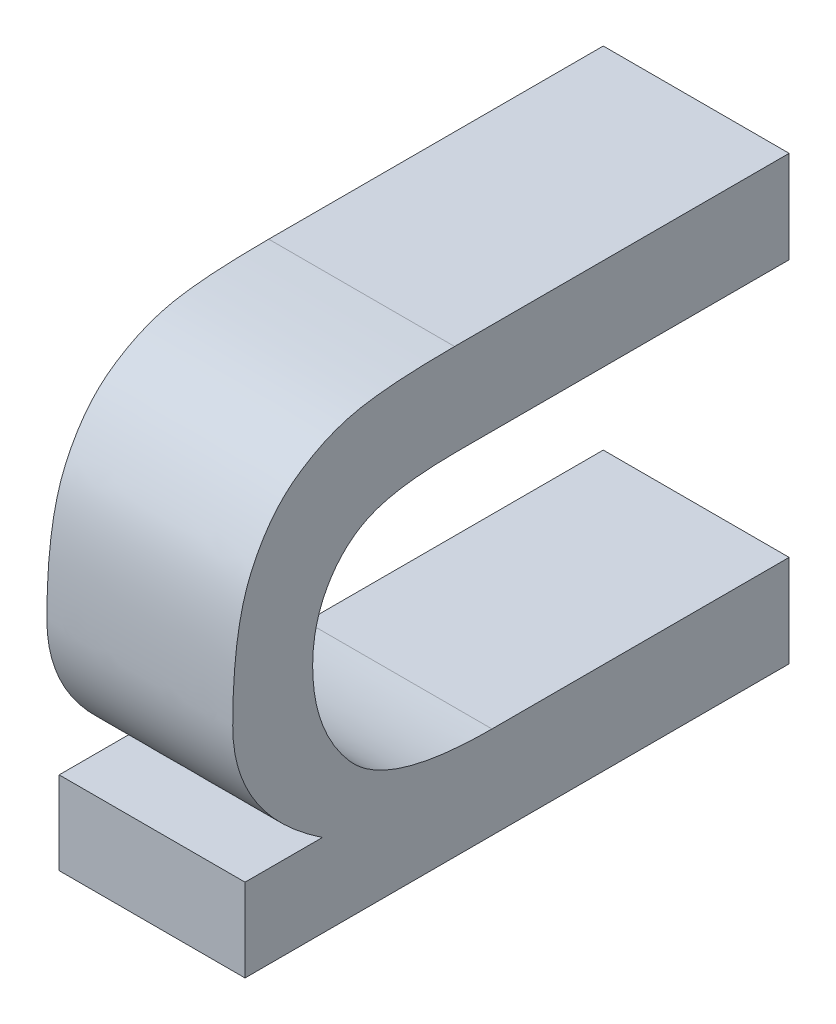
ISO-10303-21;
HEADER;
FILE_DESCRIPTION(('STEP AP214'),'2;1');
FILE_NAME('part.step','',(''),(''),'','','');
FILE_SCHEMA(('AUTOMOTIVE_DESIGN { 1 0 10303 214 1 1 1 1 }'));
ENDSEC;
DATA;
#1=APPLICATION_CONTEXT('core data for automotive mechanical design processes');
#2=APPLICATION_PROTOCOL_DEFINITION('international standard','automotive_design',2000,#1);
#3=PRODUCT_CONTEXT('',#1,'mechanical');
#4=PRODUCT('Part','Part','',(#3));
#5=PRODUCT_RELATED_PRODUCT_CATEGORY('part','',(#4));
#6=PRODUCT_DEFINITION_FORMATION('','',#4);
#7=PRODUCT_DEFINITION_CONTEXT('part definition',#1,'design');
#8=PRODUCT_DEFINITION('design','',#6,#7);
#9=PRODUCT_DEFINITION_SHAPE('','',#8);
#10=(LENGTH_UNIT() NAMED_UNIT(*) SI_UNIT(.MILLI.,.METRE.));
#11=(NAMED_UNIT(*) PLANE_ANGLE_UNIT() SI_UNIT($,.RADIAN.));
#12=(NAMED_UNIT(*) SI_UNIT($,.STERADIAN.) SOLID_ANGLE_UNIT());
#13=UNCERTAINTY_MEASURE_WITH_UNIT(LENGTH_MEASURE(1.E-05),#10,'distance_accuracy_value','');
#14=(GEOMETRIC_REPRESENTATION_CONTEXT(3) GLOBAL_UNCERTAINTY_ASSIGNED_CONTEXT((#13)) GLOBAL_UNIT_ASSIGNED_CONTEXT((#10,
#11,#12)) REPRESENTATION_CONTEXT('',''));
#15=CARTESIAN_POINT('',(0.,0.,0.));
#16=DIRECTION('',(0.,0.,1.));
#17=DIRECTION('',(1.,0.,0.));
#18=AXIS2_PLACEMENT_3D('',#15,#16,#17);
#19=CARTESIAN_POINT('',(4.55229940712896,-38.1413479114735,-8.87538537038162));
#20=DIRECTION('',(-1.,0.,0.));
#21=DIRECTION('',(0.,0.,1.));
#22=AXIS2_PLACEMENT_3D('',#19,#20,#21);
#23=PLANE('',#22);
#24=CARTESIAN_POINT('',(4.55229940712895,-38.0669559077334,-8.96104471327083));
#25=CARTESIAN_POINT('',(4.55229940712895,-38.034704441545,-8.91280534076686));
#26=CARTESIAN_POINT('',(4.55229940712893,-37.9473222639236,-8.91280534076686));
#27=CARTESIAN_POINT('',(4.55229940712893,-37.9029420412199,-8.93182543621128));
#28=CARTESIAN_POINT('',(4.55229940712892,-37.8808897566466,-8.96269863461382));
#29=CARTESIAN_POINT('',(4.55229940712892,-37.8737227641603,-8.99770663637385));
#30=CARTESIAN_POINT('',(4.55229940712892,-37.8737227641603,-9.03216333101954));
#31=(BOUNDED_CURVE() B_SPLINE_CURVE(2,(#24,#25,#26,#27,#28,#29,#30),.UNSPECIFIED.,.F.,
.F.) B_SPLINE_CURVE_WITH_KNOTS((3,1,1,1,1,3),(16.6383776414451,17.6383776414451,
18.6383776414451,19.6383776414451,20.6383776414451,21.6383776414451),
.UNSPECIFIED.) CURVE() GEOMETRIC_REPRESENTATION_ITEM() RATIONAL_B_SPLINE_CURVE((1.,1.,1.,1.,1.,
1.,1.)) REPRESENTATION_ITEM(''));
#32=CARTESIAN_POINT('',(4.55229940712895,-38.0669559077334,-8.96104471327083));
#33=VERTEX_POINT('',#32);
#34=CARTESIAN_POINT('',(4.55229940712892,-37.8737227641603,-9.03216333101954));
#35=VERTEX_POINT('',#34);
#36=EDGE_CURVE('E95',#33,#35,#31,.T.);
#37=ORIENTED_EDGE('',*,*,#36,.T.);
#38=CARTESIAN_POINT('',(4.55229940712892,-37.8737227641603,-9.03216333101954));
#39=CARTESIAN_POINT('',(4.55229940712893,-37.8737227641603,-9.12216421743409));
#40=CARTESIAN_POINT('',(4.55229940712893,-37.8737227641603,-9.21216510384864));
#41=(BOUNDED_CURVE() B_SPLINE_CURVE(2,(#38,#39,#40),.UNSPECIFIED.,.F.,
.F.) B_SPLINE_CURVE_WITH_KNOTS((3,3),(21.6383776414451,22.6383776414451),
.UNSPECIFIED.) CURVE() GEOMETRIC_REPRESENTATION_ITEM() RATIONAL_B_SPLINE_CURVE((1.,1.,1.)) REPRESENTATION_ITEM(''));
#42=CARTESIAN_POINT('',(4.55229940712893,-37.8737227641603,-9.21216510384864));
#43=VERTEX_POINT('',#42);
#44=EDGE_CURVE('E160',#35,#43,#41,.T.);
#45=ORIENTED_EDGE('',*,*,#44,.T.);
#46=CARTESIAN_POINT('',(4.55229940712893,-37.8737227641603,-9.21216510384864));
#47=CARTESIAN_POINT('',(4.55229940712893,-37.8985315843052,-9.21216510384864));
#48=CARTESIAN_POINT('',(4.55229940712893,-37.9233404044501,-9.21216510384864));
#49=(BOUNDED_CURVE() B_SPLINE_CURVE(2,(#46,#47,#48),.UNSPECIFIED.,.F.,
.F.) B_SPLINE_CURVE_WITH_KNOTS((3,3),(22.6383776414451,23.6383776414451),
.UNSPECIFIED.) CURVE() GEOMETRIC_REPRESENTATION_ITEM() RATIONAL_B_SPLINE_CURVE((1.,1.,1.)) REPRESENTATION_ITEM(''));
#50=CARTESIAN_POINT('',(4.55229940712893,-37.9233404044501,-9.21216510384864));
#51=VERTEX_POINT('',#50);
#52=EDGE_CURVE('E227',#43,#51,#49,.T.);
#53=ORIENTED_EDGE('',*,*,#52,.T.);
#54=CARTESIAN_POINT('',(4.55229940712893,-37.9233404044501,-9.21216510384864));
#55=CARTESIAN_POINT('',(4.55229940712893,-37.9233404044501,-9.12312900488417));
#56=CARTESIAN_POINT('',(4.55229940712893,-37.9233404044501,-9.0340929059197));
#57=(BOUNDED_CURVE() B_SPLINE_CURVE(2,(#54,#55,#56),.UNSPECIFIED.,.F.,
.F.) B_SPLINE_CURVE_WITH_KNOTS((3,3),(23.6383776414451,24.6383776414451),
.UNSPECIFIED.) CURVE() GEOMETRIC_REPRESENTATION_ITEM() RATIONAL_B_SPLINE_CURVE((1.,1.,1.)) REPRESENTATION_ITEM(''));
#58=CARTESIAN_POINT('',(4.55229940712893,-37.9233404044501,-9.0340929059197));
#59=VERTEX_POINT('',#58);
#60=EDGE_CURVE('E180',#51,#59,#57,.T.);
#61=ORIENTED_EDGE('',*,*,#60,.T.);
#62=CARTESIAN_POINT('',(4.55229940712893,-37.9233404044501,-9.0340929059197));
#63=CARTESIAN_POINT('',(4.55229940712893,-37.9233404044501,-9.00377101463149));
#64=CARTESIAN_POINT('',(4.55229940712893,-37.9291291291506,-8.98874789576596));
#65=CARTESIAN_POINT('',(4.55229940712893,-37.9349178538511,-8.97372477690045));
#66=CARTESIAN_POINT('',(4.55229940712894,-37.9496653191595,-8.96476603629257));
#67=CARTESIAN_POINT('',(4.55229940712894,-37.9644127844678,-8.95580729568469));
#68=CARTESIAN_POINT('',(4.55229940712894,-37.9842598405837,-8.95580729568469));
#69=CARTESIAN_POINT('',(4.55229940712894,-38.0159599996578,-8.95580729568469));
#70=CARTESIAN_POINT('',(4.55229940712895,-38.0389770716811,-8.97593000535777));
#71=CARTESIAN_POINT('',(4.55229940712895,-38.0619941437044,-8.99605271503085));
#72=CARTESIAN_POINT('',(4.55229940712895,-38.0619941437044,-9.05228604069263));
#73=(BOUNDED_CURVE() B_SPLINE_CURVE(2,(#62,#63,#64,#65,#66,#67,#68,#69,#70,#71,#72),
.UNSPECIFIED.,.F.,.F.) B_SPLINE_CURVE_WITH_KNOTS((3,2,2,2,2,3),(24.6383776414451,
25.6383776414451,26.6383776414451,27.6383776414451,28.6383776414451,29.6383776414451),
.UNSPECIFIED.) CURVE() GEOMETRIC_REPRESENTATION_ITEM() RATIONAL_B_SPLINE_CURVE((1.,1.,1.,1.,1.,
1.,1.,1.,1.,1.,1.)) REPRESENTATION_ITEM(''));
#74=CARTESIAN_POINT('',(4.55229940712895,-38.0619941437044,-9.05228604069263));
#75=VERTEX_POINT('',#74);
#76=EDGE_CURVE('E189',#59,#75,#73,.T.);
#77=ORIENTED_EDGE('',*,*,#76,.T.);
#78=CARTESIAN_POINT('',(4.55229940712895,-38.0619941437044,-9.05228604069263));
#79=CARTESIAN_POINT('',(4.55229940712895,-38.0619941437044,-9.13222557227063));
#80=CARTESIAN_POINT('',(4.55229940712895,-38.0619941437044,-9.21216510384864));
#81=(BOUNDED_CURVE() B_SPLINE_CURVE(2,(#78,#79,#80),.UNSPECIFIED.,.F.,
.F.) B_SPLINE_CURVE_WITH_KNOTS((3,3),(29.6383776414451,30.6267893660532),
.UNSPECIFIED.) CURVE() GEOMETRIC_REPRESENTATION_ITEM() RATIONAL_B_SPLINE_CURVE((1.,1.,1.)) REPRESENTATION_ITEM(''));
#82=CARTESIAN_POINT('',(4.55229940712895,-38.0619941437044,-9.21216510384864));
#83=VERTEX_POINT('',#82);
#84=EDGE_CURVE('E147',#75,#83,#81,.T.);
#85=ORIENTED_EDGE('',*,*,#84,.T.);
#86=CARTESIAN_POINT('',(4.55229940712895,-38.0619941437044,-9.21216510384864));
#87=CARTESIAN_POINT('',(4.55229940712896,-38.0868029638493,-9.21216510384864));
#88=CARTESIAN_POINT('',(4.55229940712896,-38.1116117839942,-9.21216510384864));
#89=(BOUNDED_CURVE() B_SPLINE_CURVE(2,(#86,#87,#88),.UNSPECIFIED.,.F.,
.F.) B_SPLINE_CURVE_WITH_KNOTS((3,3),(30.6267893660532,30.9335378323108),
.UNSPECIFIED.) CURVE() GEOMETRIC_REPRESENTATION_ITEM() RATIONAL_B_SPLINE_CURVE((1.,1.,1.)) REPRESENTATION_ITEM(''));
#90=CARTESIAN_POINT('',(4.55229940712896,-38.1116117839942,-9.21216510384864));
#91=VERTEX_POINT('',#90);
#92=EDGE_CURVE('E297',#83,#91,#89,.T.);
#93=ORIENTED_EDGE('',*,*,#92,.T.);
#94=CARTESIAN_POINT('',(4.55229940712896,-38.1116117839942,-9.21216510384864));
#95=CARTESIAN_POINT('',(4.55229940712896,-38.1116117839942,-9.06579306499374));
#96=CARTESIAN_POINT('',(4.55229940712896,-38.1116117839942,-8.91942102613884));
#97=(BOUNDED_CURVE() B_SPLINE_CURVE(2,(#94,#95,#96),.UNSPECIFIED.,.F.,
.F.) B_SPLINE_CURVE_WITH_KNOTS((3,3),(30.9335378323108,32.7433537832311),
.UNSPECIFIED.) CURVE() GEOMETRIC_REPRESENTATION_ITEM() RATIONAL_B_SPLINE_CURVE((1.,1.,1.)) REPRESENTATION_ITEM(''));
#98=CARTESIAN_POINT('',(4.55229940712896,-38.1116117839942,-8.91942102613884));
#99=VERTEX_POINT('',#98);
#100=EDGE_CURVE('E138',#91,#99,#97,.T.);
#101=ORIENTED_EDGE('',*,*,#100,.T.);
#102=CARTESIAN_POINT('',(4.55229940712896,-38.1116117839942,-8.91942102613884));
#103=CARTESIAN_POINT('',(4.55229940712895,-38.0892838458638,-8.91942102613884));
#104=CARTESIAN_POINT('',(4.55229940712895,-38.0669559077334,-8.91942102613884));
#105=(BOUNDED_CURVE() B_SPLINE_CURVE(2,(#102,#103,#104),.UNSPECIFIED.,.F.,
.F.) B_SPLINE_CURVE_WITH_KNOTS((3,3),(32.7433537832311,33.019427402863),
.UNSPECIFIED.) CURVE() GEOMETRIC_REPRESENTATION_ITEM() RATIONAL_B_SPLINE_CURVE((1.,1.,1.)) REPRESENTATION_ITEM(''));
#106=CARTESIAN_POINT('',(4.55229940712895,-38.0669559077334,-8.91942102613884));
#107=VERTEX_POINT('',#106);
#108=EDGE_CURVE('E22',#99,#107,#105,.T.);
#109=ORIENTED_EDGE('',*,*,#108,.T.);
#110=CARTESIAN_POINT('',(4.55229940712895,-38.0669559077334,-8.91942102613884));
#111=CARTESIAN_POINT('',(4.55229940712895,-38.0669559077334,-8.94023286970483));
#112=CARTESIAN_POINT('',(4.55229940712895,-38.0669559077334,-8.96104471327083));
#113=(BOUNDED_CURVE() B_SPLINE_CURVE(2,(#110,#111,#112),.UNSPECIFIED.,.F.,
.F.) B_SPLINE_CURVE_WITH_KNOTS((3,3),(33.019427402863,33.2767552828903),
.UNSPECIFIED.) CURVE() GEOMETRIC_REPRESENTATION_ITEM() RATIONAL_B_SPLINE_CURVE((1.,1.,1.)) REPRESENTATION_ITEM(''));
#114=EDGE_CURVE('E11',#107,#33,#113,.T.);
#115=ORIENTED_EDGE('',*,*,#114,.T.);
#116=EDGE_LOOP('',(#37,#45,#53,#61,#77,#85,#93,#101,#109,#115));
#117=FACE_BOUND('',#116,.T.);
#118=ADVANCED_FACE('F16',(#117),#23,.T.);
#119=CARTESIAN_POINT('',(4.65229940712896,-38.1413479114734,-8.87538537038163));
#120=DIRECTION('',(1.,0.,0.));
#121=DIRECTION('',(0.,1.,0.));
#122=AXIS2_PLACEMENT_3D('',#119,#120,#121);
#123=PLANE('',#122);
#124=CARTESIAN_POINT('',(4.65229940712895,-38.0669559077334,-8.91942102613884));
#125=CARTESIAN_POINT('',(4.65229940712895,-38.0669559077334,-8.94023286970484));
#126=CARTESIAN_POINT('',(4.65229940712895,-38.0669559077334,-8.96104471327083));
#127=(BOUNDED_CURVE() B_SPLINE_CURVE(2,(#124,#125,#126),.UNSPECIFIED.,.F.,
.F.) B_SPLINE_CURVE_WITH_KNOTS((3,3),(33.019427402863,33.2767552828903),
.UNSPECIFIED.) CURVE() GEOMETRIC_REPRESENTATION_ITEM() RATIONAL_B_SPLINE_CURVE((1.,1.,1.)) REPRESENTATION_ITEM(''));
#128=CARTESIAN_POINT('',(4.65229940712895,-38.0669559077334,-8.91942102613884));
#129=VERTEX_POINT('',#128);
#130=CARTESIAN_POINT('',(4.65229940712895,-38.0669559077334,-8.96104471327083));
#131=VERTEX_POINT('',#130);
#132=EDGE_CURVE('E31',#129,#131,#127,.T.);
#133=ORIENTED_EDGE('',*,*,#132,.F.);
#134=CARTESIAN_POINT('',(4.65229940712896,-38.1116117839942,-8.91942102613884));
#135=CARTESIAN_POINT('',(4.65229940712896,-38.0892838458638,-8.91942102613884));
#136=CARTESIAN_POINT('',(4.65229940712895,-38.0669559077334,-8.91942102613884));
#137=(BOUNDED_CURVE() B_SPLINE_CURVE(2,(#134,#135,#136),.UNSPECIFIED.,.F.,
.F.) B_SPLINE_CURVE_WITH_KNOTS((3,3),(32.7433537832311,33.019427402863),
.UNSPECIFIED.) CURVE() GEOMETRIC_REPRESENTATION_ITEM() RATIONAL_B_SPLINE_CURVE((1.,1.,1.)) REPRESENTATION_ITEM(''));
#138=CARTESIAN_POINT('',(4.65229940712896,-38.1116117839942,-8.91942102613884));
#139=VERTEX_POINT('',#138);
#140=EDGE_CURVE('E129',#139,#129,#137,.T.);
#141=ORIENTED_EDGE('',*,*,#140,.F.);
#142=CARTESIAN_POINT('',(4.65229940712896,-38.1116117839942,-9.21216510384864));
#143=CARTESIAN_POINT('',(4.65229940712896,-38.1116117839942,-9.06579306499374));
#144=CARTESIAN_POINT('',(4.65229940712896,-38.1116117839942,-8.91942102613884));
#145=(BOUNDED_CURVE() B_SPLINE_CURVE(2,(#142,#143,#144),.UNSPECIFIED.,.F.,
.F.) B_SPLINE_CURVE_WITH_KNOTS((3,3),(30.9335378323108,32.7433537832311),
.UNSPECIFIED.) CURVE() GEOMETRIC_REPRESENTATION_ITEM() RATIONAL_B_SPLINE_CURVE((1.,1.,1.)) REPRESENTATION_ITEM(''));
#146=CARTESIAN_POINT('',(4.65229940712896,-38.1116117839942,-9.21216510384864));
#147=VERTEX_POINT('',#146);
#148=EDGE_CURVE('E306',#147,#139,#145,.T.);
#149=ORIENTED_EDGE('',*,*,#148,.F.);
#150=CARTESIAN_POINT('',(4.65229940712896,-38.0619941437044,-9.21216510384864));
#151=CARTESIAN_POINT('',(4.65229940712896,-38.0868029638493,-9.21216510384864));
#152=CARTESIAN_POINT('',(4.65229940712896,-38.1116117839942,-9.21216510384864));
#153=(BOUNDED_CURVE() B_SPLINE_CURVE(2,(#150,#151,#152),.UNSPECIFIED.,.F.,
.F.) B_SPLINE_CURVE_WITH_KNOTS((3,3),(30.6267893660532,30.9335378323108),
.UNSPECIFIED.) CURVE() GEOMETRIC_REPRESENTATION_ITEM() RATIONAL_B_SPLINE_CURVE((1.,1.,1.)) REPRESENTATION_ITEM(''));
#154=CARTESIAN_POINT('',(4.65229940712896,-38.0619941437044,-9.21216510384864));
#155=VERTEX_POINT('',#154);
#156=EDGE_CURVE('E250',#155,#147,#153,.T.);
#157=ORIENTED_EDGE('',*,*,#156,.F.);
#158=CARTESIAN_POINT('',(4.65229940712895,-38.0619941437044,-9.05228604069263));
#159=CARTESIAN_POINT('',(4.65229940712895,-38.0619941437044,-9.13222557227064));
#160=CARTESIAN_POINT('',(4.65229940712896,-38.0619941437044,-9.21216510384864));
#161=(BOUNDED_CURVE() B_SPLINE_CURVE(2,(#158,#159,#160),.UNSPECIFIED.,.F.,
.F.) B_SPLINE_CURVE_WITH_KNOTS((3,3),(29.6383776414451,30.6267893660532),
.UNSPECIFIED.) CURVE() GEOMETRIC_REPRESENTATION_ITEM() RATIONAL_B_SPLINE_CURVE((1.,1.,1.)) REPRESENTATION_ITEM(''));
#162=CARTESIAN_POINT('',(4.65229940712895,-38.0619941437044,-9.05228604069263));
#163=VERTEX_POINT('',#162);
#164=EDGE_CURVE('E148',#163,#155,#161,.T.);
#165=ORIENTED_EDGE('',*,*,#164,.F.);
#166=CARTESIAN_POINT('',(4.65229940712893,-37.9233404044501,-9.0340929059197));
#167=CARTESIAN_POINT('',(4.65229940712893,-37.9233404044501,-9.00377101463149));
#168=CARTESIAN_POINT('',(4.65229940712893,-37.9291291291506,-8.98874789576597));
#169=CARTESIAN_POINT('',(4.65229940712893,-37.9349178538511,-8.97372477690045));
#170=CARTESIAN_POINT('',(4.65229940712894,-37.9496653191595,-8.96476603629257));
#171=CARTESIAN_POINT('',(4.65229940712894,-37.9644127844678,-8.95580729568469));
#172=CARTESIAN_POINT('',(4.65229940712894,-37.9842598405837,-8.95580729568469));
#173=CARTESIAN_POINT('',(4.65229940712895,-38.0159599996578,-8.95580729568469));
#174=CARTESIAN_POINT('',(4.65229940712895,-38.0389770716811,-8.97593000535777));
#175=CARTESIAN_POINT('',(4.65229940712895,-38.0619941437044,-8.99605271503086));
#176=CARTESIAN_POINT('',(4.65229940712895,-38.0619941437044,-9.05228604069263));
#177=(BOUNDED_CURVE() B_SPLINE_CURVE(2,(#166,#167,#168,#169,#170,#171,#172,#173,#174,#175,#176),
.UNSPECIFIED.,.F.,.F.) B_SPLINE_CURVE_WITH_KNOTS((3,2,2,2,2,3),(24.6383776414451,
25.6383776414451,26.6383776414451,27.6383776414451,28.6383776414451,29.6383776414451),
.UNSPECIFIED.) CURVE() GEOMETRIC_REPRESENTATION_ITEM() RATIONAL_B_SPLINE_CURVE((1.,1.,1.,1.,1.,
1.,1.,1.,1.,1.,1.)) REPRESENTATION_ITEM(''));
#178=CARTESIAN_POINT('',(4.65229940712893,-37.9233404044501,-9.0340929059197));
#179=VERTEX_POINT('',#178);
#180=EDGE_CURVE('E170',#179,#163,#177,.T.);
#181=ORIENTED_EDGE('',*,*,#180,.F.);
#182=CARTESIAN_POINT('',(4.65229940712894,-37.9233404044501,-9.21216510384864));
#183=CARTESIAN_POINT('',(4.65229940712893,-37.9233404044501,-9.12312900488417));
#184=CARTESIAN_POINT('',(4.65229940712893,-37.9233404044501,-9.0340929059197));
#185=(BOUNDED_CURVE() B_SPLINE_CURVE(2,(#182,#183,#184),.UNSPECIFIED.,.F.,
.F.) B_SPLINE_CURVE_WITH_KNOTS((3,3),(23.6383776414451,24.6383776414451),
.UNSPECIFIED.) CURVE() GEOMETRIC_REPRESENTATION_ITEM() RATIONAL_B_SPLINE_CURVE((1.,1.,1.)) REPRESENTATION_ITEM(''));
#186=CARTESIAN_POINT('',(4.65229940712894,-37.9233404044501,-9.21216510384864));
#187=VERTEX_POINT('',#186);
#188=EDGE_CURVE('E214',#187,#179,#185,.T.);
#189=ORIENTED_EDGE('',*,*,#188,.F.);
#190=CARTESIAN_POINT('',(4.65229940712893,-37.8737227641603,-9.21216510384864));
#191=CARTESIAN_POINT('',(4.65229940712893,-37.8985315843052,-9.21216510384864));
#192=CARTESIAN_POINT('',(4.65229940712894,-37.9233404044501,-9.21216510384864));
#193=(BOUNDED_CURVE() B_SPLINE_CURVE(2,(#190,#191,#192),.UNSPECIFIED.,.F.,
.F.) B_SPLINE_CURVE_WITH_KNOTS((3,3),(22.6383776414451,23.6383776414451),
.UNSPECIFIED.) CURVE() GEOMETRIC_REPRESENTATION_ITEM() RATIONAL_B_SPLINE_CURVE((1.,1.,1.)) REPRESENTATION_ITEM(''));
#194=CARTESIAN_POINT('',(4.65229940712893,-37.8737227641603,-9.21216510384864));
#195=VERTEX_POINT('',#194);
#196=EDGE_CURVE('E168',#195,#187,#193,.T.);
#197=ORIENTED_EDGE('',*,*,#196,.F.);
#198=CARTESIAN_POINT('',(4.65229940712893,-37.8737227641603,-9.03216333101954));
#199=CARTESIAN_POINT('',(4.65229940712893,-37.8737227641603,-9.12216421743409));
#200=CARTESIAN_POINT('',(4.65229940712893,-37.8737227641603,-9.21216510384864));
#201=(BOUNDED_CURVE() B_SPLINE_CURVE(2,(#198,#199,#200),.UNSPECIFIED.,.F.,
.F.) B_SPLINE_CURVE_WITH_KNOTS((3,3),(21.6383776414451,22.6383776414451),
.UNSPECIFIED.) CURVE() GEOMETRIC_REPRESENTATION_ITEM() RATIONAL_B_SPLINE_CURVE((1.,1.,1.)) REPRESENTATION_ITEM(''));
#202=CARTESIAN_POINT('',(4.65229940712893,-37.8737227641603,-9.03216333101954));
#203=VERTEX_POINT('',#202);
#204=EDGE_CURVE('E109',#203,#195,#201,.T.);
#205=ORIENTED_EDGE('',*,*,#204,.F.);
#206=CARTESIAN_POINT('',(4.65229940712895,-38.0669559077334,-8.96104471327083));
#207=CARTESIAN_POINT('',(4.65229940712895,-38.034704441545,-8.91280534076686));
#208=CARTESIAN_POINT('',(4.65229940712894,-37.9473222639235,-8.91280534076686));
#209=CARTESIAN_POINT('',(4.65229940712893,-37.9029420412199,-8.93182543621128));
#210=CARTESIAN_POINT('',(4.65229940712893,-37.8808897566466,-8.96269863461382));
#211=CARTESIAN_POINT('',(4.65229940712893,-37.8737227641603,-8.99770663637385));
#212=CARTESIAN_POINT('',(4.65229940712893,-37.8737227641603,-9.03216333101954));
#213=(BOUNDED_CURVE() B_SPLINE_CURVE(2,(#206,#207,#208,#209,#210,#211,#212),.UNSPECIFIED.,.F.,
.F.) B_SPLINE_CURVE_WITH_KNOTS((3,1,1,1,1,3),(16.6383776414451,17.6383776414451,
18.6383776414451,19.6383776414451,20.6383776414451,21.6383776414451),
.UNSPECIFIED.) CURVE() GEOMETRIC_REPRESENTATION_ITEM() RATIONAL_B_SPLINE_CURVE((1.,1.,1.,1.,1.,
1.,1.)) REPRESENTATION_ITEM(''));
#214=EDGE_CURVE('E120',#131,#203,#213,.T.);
#215=ORIENTED_EDGE('',*,*,#214,.F.);
#216=EDGE_LOOP('',(#133,#141,#149,#157,#165,#181,#189,#197,#205,#215));
#217=FACE_BOUND('',#216,.T.);
#218=ADVANCED_FACE('F369',(#217),#123,.T.);
#219=CARTESIAN_POINT('',(4.65229940712895,-38.0669559077334,-8.91942102613884));
#220=CARTESIAN_POINT('',(4.55229940712895,-38.0669559077334,-8.91942102613884));
#221=CARTESIAN_POINT('',(4.65229940712895,-38.0669559077334,-8.94023286970484));
#222=CARTESIAN_POINT('',(4.55229940712895,-38.0669559077334,-8.94023286970483));
#223=CARTESIAN_POINT('',(4.65229940712895,-38.0669559077334,-8.96104471327083));
#224=CARTESIAN_POINT('',(4.55229940712895,-38.0669559077334,-8.96104471327083));
#225=(BOUNDED_SURFACE() B_SPLINE_SURFACE(2,1,((#219,#220),(#221,#222),(#223,#224)),
.UNSPECIFIED.,.F.,.F.,.F.) B_SPLINE_SURFACE_WITH_KNOTS((3,3),(2,2),(33.019427402863,
33.2767552828903),(0.,0.1),
.UNSPECIFIED.) GEOMETRIC_REPRESENTATION_ITEM() RATIONAL_B_SPLINE_SURFACE(((1.,1.),(1.,1.),(1.,1.))) REPRESENTATION_ITEM('') SURFACE());
#226=CARTESIAN_POINT('',(4.65229940712895,-38.0669559077334,-8.96104471327083));
#227=CARTESIAN_POINT('',(4.55229940712895,-38.0669559077334,-8.96104471327083));
#228=(BOUNDED_CURVE() B_SPLINE_CURVE(1,(#226,#227),.UNSPECIFIED.,.F.,
.F.) B_SPLINE_CURVE_WITH_KNOTS((2,2),(0.,0.1),
.UNSPECIFIED.) CURVE() GEOMETRIC_REPRESENTATION_ITEM() RATIONAL_B_SPLINE_CURVE((1.,1.)) REPRESENTATION_ITEM(''));
#229=EDGE_CURVE('E102',#131,#33,#228,.T.);
#230=CARTESIAN_POINT('',(4.65229940712895,-38.0669559077334,-8.91942102613884));
#231=CARTESIAN_POINT('',(4.55229940712895,-38.0669559077334,-8.91942102613884));
#232=(BOUNDED_CURVE() B_SPLINE_CURVE(1,(#230,#231),.UNSPECIFIED.,.F.,
.F.) B_SPLINE_CURVE_WITH_KNOTS((2,2),(0.,0.1),
.UNSPECIFIED.) CURVE() GEOMETRIC_REPRESENTATION_ITEM() RATIONAL_B_SPLINE_CURVE((1.,1.)) REPRESENTATION_ITEM(''));
#233=EDGE_CURVE('E137',#129,#107,#232,.T.);
#234=ORIENTED_EDGE('',*,*,#132,.T.);
#235=ORIENTED_EDGE('',*,*,#229,.T.);
#236=ORIENTED_EDGE('',*,*,#114,.F.);
#237=ORIENTED_EDGE('',*,*,#233,.F.);
#238=EDGE_LOOP('',(#234,#235,#236,#237));
#239=FACE_BOUND('',#238,.T.);
#240=ADVANCED_FACE('F103',(#239),#225,.T.);
#241=CARTESIAN_POINT('',(4.65229940712896,-38.1116117839942,-8.91942102613884));
#242=CARTESIAN_POINT('',(4.55229940712896,-38.1116117839942,-8.91942102613884));
#243=CARTESIAN_POINT('',(4.65229940712896,-38.0892838458638,-8.91942102613884));
#244=CARTESIAN_POINT('',(4.55229940712895,-38.0892838458638,-8.91942102613884));
#245=CARTESIAN_POINT('',(4.65229940712895,-38.0669559077334,-8.91942102613884));
#246=CARTESIAN_POINT('',(4.55229940712895,-38.0669559077334,-8.91942102613884));
#247=(BOUNDED_SURFACE() B_SPLINE_SURFACE(2,1,((#241,#242),(#243,#244),(#245,#246)),
.UNSPECIFIED.,.F.,.F.,.F.) B_SPLINE_SURFACE_WITH_KNOTS((3,3),(2,2),(32.7433537832311,
33.019427402863),(0.,0.1),
.UNSPECIFIED.) GEOMETRIC_REPRESENTATION_ITEM() RATIONAL_B_SPLINE_SURFACE(((1.,1.),(1.,1.),(1.,1.))) REPRESENTATION_ITEM('') SURFACE());
#248=CARTESIAN_POINT('',(4.65229940712896,-38.1116117839942,-8.91942102613884));
#249=CARTESIAN_POINT('',(4.55229940712896,-38.1116117839942,-8.91942102613884));
#250=(BOUNDED_CURVE() B_SPLINE_CURVE(1,(#248,#249),.UNSPECIFIED.,.F.,
.F.) B_SPLINE_CURVE_WITH_KNOTS((2,2),(0.,0.1),
.UNSPECIFIED.) CURVE() GEOMETRIC_REPRESENTATION_ITEM() RATIONAL_B_SPLINE_CURVE((1.,1.)) REPRESENTATION_ITEM(''));
#251=EDGE_CURVE('E197',#139,#99,#250,.T.);
#252=ORIENTED_EDGE('',*,*,#140,.T.);
#253=ORIENTED_EDGE('',*,*,#233,.T.);
#254=ORIENTED_EDGE('',*,*,#108,.F.);
#255=ORIENTED_EDGE('',*,*,#251,.F.);
#256=EDGE_LOOP('',(#252,#253,#254,#255));
#257=FACE_BOUND('',#256,.T.);
#258=ADVANCED_FACE('F346',(#257),#247,.T.);
#259=CARTESIAN_POINT('',(4.65229940712896,-38.1116117839942,-9.21216510384864));
#260=CARTESIAN_POINT('',(4.55229940712896,-38.1116117839942,-9.21216510384864));
#261=CARTESIAN_POINT('',(4.65229940712896,-38.1116117839942,-9.06579306499374));
#262=CARTESIAN_POINT('',(4.55229940712896,-38.1116117839942,-9.06579306499374));
#263=CARTESIAN_POINT('',(4.65229940712896,-38.1116117839942,-8.91942102613884));
#264=CARTESIAN_POINT('',(4.55229940712896,-38.1116117839942,-8.91942102613884));
#265=(BOUNDED_SURFACE() B_SPLINE_SURFACE(2,1,((#259,#260),(#261,#262),(#263,#264)),
.UNSPECIFIED.,.F.,.F.,.F.) B_SPLINE_SURFACE_WITH_KNOTS((3,3),(2,2),(30.9335378323108,
32.7433537832311),(0.,0.1),
.UNSPECIFIED.) GEOMETRIC_REPRESENTATION_ITEM() RATIONAL_B_SPLINE_SURFACE(((1.,1.),(1.,1.),(1.,1.))) REPRESENTATION_ITEM('') SURFACE());
#266=CARTESIAN_POINT('',(4.65229940712896,-38.1116117839942,-9.21216510384864));
#267=CARTESIAN_POINT('',(4.55229940712896,-38.1116117839942,-9.21216510384864));
#268=(BOUNDED_CURVE() B_SPLINE_CURVE(1,(#266,#267),.UNSPECIFIED.,.F.,
.F.) B_SPLINE_CURVE_WITH_KNOTS((2,2),(0.,0.1),
.UNSPECIFIED.) CURVE() GEOMETRIC_REPRESENTATION_ITEM() RATIONAL_B_SPLINE_CURVE((1.,1.)) REPRESENTATION_ITEM(''));
#269=EDGE_CURVE('E280',#147,#91,#268,.T.);
#270=ORIENTED_EDGE('',*,*,#148,.T.);
#271=ORIENTED_EDGE('',*,*,#251,.T.);
#272=ORIENTED_EDGE('',*,*,#100,.F.);
#273=ORIENTED_EDGE('',*,*,#269,.F.);
#274=EDGE_LOOP('',(#270,#271,#272,#273));
#275=FACE_BOUND('',#274,.T.);
#276=ADVANCED_FACE('F342',(#275),#265,.T.);
#277=CARTESIAN_POINT('',(4.65229940712896,-38.0619941437044,-9.21216510384864));
#278=CARTESIAN_POINT('',(4.55229940712895,-38.0619941437044,-9.21216510384864));
#279=CARTESIAN_POINT('',(4.65229940712896,-38.0868029638493,-9.21216510384864));
#280=CARTESIAN_POINT('',(4.55229940712896,-38.0868029638493,-9.21216510384864));
#281=CARTESIAN_POINT('',(4.65229940712896,-38.1116117839942,-9.21216510384864));
#282=CARTESIAN_POINT('',(4.55229940712896,-38.1116117839942,-9.21216510384864));
#283=(BOUNDED_SURFACE() B_SPLINE_SURFACE(2,1,((#277,#278),(#279,#280),(#281,#282)),
.UNSPECIFIED.,.F.,.F.,.F.) B_SPLINE_SURFACE_WITH_KNOTS((3,3),(2,2),(30.6267893660532,
30.9335378323108),(0.,0.1),
.UNSPECIFIED.) GEOMETRIC_REPRESENTATION_ITEM() RATIONAL_B_SPLINE_SURFACE(((1.,1.),(1.,1.),(1.,1.))) REPRESENTATION_ITEM('') SURFACE());
#284=CARTESIAN_POINT('',(4.65229940712896,-38.0619941437044,-9.21216510384864));
#285=CARTESIAN_POINT('',(4.55229940712895,-38.0619941437044,-9.21216510384864));
#286=(BOUNDED_CURVE() B_SPLINE_CURVE(1,(#284,#285),.UNSPECIFIED.,.F.,
.F.) B_SPLINE_CURVE_WITH_KNOTS((2,2),(0.,0.1),
.UNSPECIFIED.) CURVE() GEOMETRIC_REPRESENTATION_ITEM() RATIONAL_B_SPLINE_CURVE((1.,1.)) REPRESENTATION_ITEM(''));
#287=EDGE_CURVE('E139',#155,#83,#286,.T.);
#288=ORIENTED_EDGE('',*,*,#156,.T.);
#289=ORIENTED_EDGE('',*,*,#269,.T.);
#290=ORIENTED_EDGE('',*,*,#92,.F.);
#291=ORIENTED_EDGE('',*,*,#287,.F.);
#292=EDGE_LOOP('',(#288,#289,#290,#291));
#293=FACE_BOUND('',#292,.T.);
#294=ADVANCED_FACE('F383',(#293),#283,.T.);
#295=CARTESIAN_POINT('',(4.65229940712895,-38.0619941437044,-9.05228604069263));
#296=CARTESIAN_POINT('',(4.55229940712895,-38.0619941437044,-9.05228604069263));
#297=CARTESIAN_POINT('',(4.65229940712895,-38.0619941437044,-9.13222557227064));
#298=CARTESIAN_POINT('',(4.55229940712895,-38.0619941437044,-9.13222557227063));
#299=CARTESIAN_POINT('',(4.65229940712896,-38.0619941437044,-9.21216510384864));
#300=CARTESIAN_POINT('',(4.55229940712895,-38.0619941437044,-9.21216510384864));
#301=(BOUNDED_SURFACE() B_SPLINE_SURFACE(2,1,((#295,#296),(#297,#298),(#299,#300)),
.UNSPECIFIED.,.F.,.F.,.F.) B_SPLINE_SURFACE_WITH_KNOTS((3,3),(2,2),(29.6383776414451,
30.6267893660532),(0.,0.1),
.UNSPECIFIED.) GEOMETRIC_REPRESENTATION_ITEM() RATIONAL_B_SPLINE_SURFACE(((1.,1.),(1.,1.),(1.,1.))) REPRESENTATION_ITEM('') SURFACE());
#302=CARTESIAN_POINT('',(4.65229940712895,-38.0619941437044,-9.05228604069263));
#303=CARTESIAN_POINT('',(4.55229940712895,-38.0619941437044,-9.05228604069263));
#304=(BOUNDED_CURVE() B_SPLINE_CURVE(1,(#302,#303),.UNSPECIFIED.,.F.,
.F.) B_SPLINE_CURVE_WITH_KNOTS((2,2),(0.,0.1),
.UNSPECIFIED.) CURVE() GEOMETRIC_REPRESENTATION_ITEM() RATIONAL_B_SPLINE_CURVE((1.,1.)) REPRESENTATION_ITEM(''));
#305=EDGE_CURVE('E179',#163,#75,#304,.T.);
#306=ORIENTED_EDGE('',*,*,#164,.T.);
#307=ORIENTED_EDGE('',*,*,#287,.T.);
#308=ORIENTED_EDGE('',*,*,#84,.F.);
#309=ORIENTED_EDGE('',*,*,#305,.F.);
#310=EDGE_LOOP('',(#306,#307,#308,#309));
#311=FACE_BOUND('',#310,.T.);
#312=ADVANCED_FACE('F372',(#311),#301,.T.);
#313=CARTESIAN_POINT('',(4.65229940712893,-37.9233404044501,-9.0340929059197));
#314=CARTESIAN_POINT('',(4.55229940712893,-37.9233404044501,-9.0340929059197));
#315=CARTESIAN_POINT('',(4.65229940712893,-37.9233404044501,-9.00377101463149));
#316=CARTESIAN_POINT('',(4.55229940712893,-37.9233404044501,-9.00377101463149));
#317=CARTESIAN_POINT('',(4.65229940712893,-37.9291291291506,-8.98874789576597));
#318=CARTESIAN_POINT('',(4.55229940712893,-37.9291291291506,-8.98874789576596));
#319=CARTESIAN_POINT('',(4.65229940712893,-37.9349178538511,-8.97372477690045));
#320=CARTESIAN_POINT('',(4.55229940712893,-37.9349178538511,-8.97372477690045));
#321=CARTESIAN_POINT('',(4.65229940712894,-37.9496653191595,-8.96476603629257));
#322=CARTESIAN_POINT('',(4.55229940712894,-37.9496653191595,-8.96476603629257));
#323=CARTESIAN_POINT('',(4.65229940712894,-37.9644127844678,-8.95580729568469));
#324=CARTESIAN_POINT('',(4.55229940712894,-37.9644127844678,-8.95580729568469));
#325=CARTESIAN_POINT('',(4.65229940712894,-37.9842598405837,-8.95580729568469));
#326=CARTESIAN_POINT('',(4.55229940712894,-37.9842598405837,-8.95580729568469));
#327=CARTESIAN_POINT('',(4.65229940712895,-38.0159599996578,-8.95580729568469));
#328=CARTESIAN_POINT('',(4.55229940712894,-38.0159599996578,-8.95580729568469));
#329=CARTESIAN_POINT('',(4.65229940712895,-38.0389770716811,-8.97593000535777));
#330=CARTESIAN_POINT('',(4.55229940712895,-38.0389770716811,-8.97593000535777));
#331=CARTESIAN_POINT('',(4.65229940712895,-38.0619941437044,-8.99605271503086));
#332=CARTESIAN_POINT('',(4.55229940712895,-38.0619941437044,-8.99605271503085));
#333=CARTESIAN_POINT('',(4.65229940712895,-38.0619941437044,-9.05228604069263));
#334=CARTESIAN_POINT('',(4.55229940712895,-38.0619941437044,-9.05228604069263));
#335=(BOUNDED_SURFACE() B_SPLINE_SURFACE(2,1,((#313,#314),(#315,#316),(#317,#318),(#319,#320),
(#321,#322),(#323,#324),(#325,#326),(#327,#328),(#329,#330),(#331,#332),(#333,#334)),
.UNSPECIFIED.,.F.,.F.,.F.) B_SPLINE_SURFACE_WITH_KNOTS((3,2,2,2,2,3),(2,2),(24.6383776414451,
25.6383776414451,26.6383776414451,27.6383776414451,28.6383776414451,29.6383776414451),(0.,0.1),
.UNSPECIFIED.) GEOMETRIC_REPRESENTATION_ITEM() RATIONAL_B_SPLINE_SURFACE(((1.,1.),(1.,1.),(1.,
1.),(1.,1.),(1.,1.),(1.,1.),(1.,1.),(1.,1.),(1.,1.),(1.,1.),(1.,1.))) REPRESENTATION_ITEM('') SURFACE());
#336=CARTESIAN_POINT('',(4.65229940712893,-37.9233404044501,-9.0340929059197));
#337=CARTESIAN_POINT('',(4.55229940712893,-37.9233404044501,-9.0340929059197));
#338=(BOUNDED_CURVE() B_SPLINE_CURVE(1,(#336,#337),.UNSPECIFIED.,.F.,
.F.) B_SPLINE_CURVE_WITH_KNOTS((2,2),(0.,0.1),
.UNSPECIFIED.) CURVE() GEOMETRIC_REPRESENTATION_ITEM() RATIONAL_B_SPLINE_CURVE((1.,1.)) REPRESENTATION_ITEM(''));
#339=EDGE_CURVE('E206',#179,#59,#338,.T.);
#340=ORIENTED_EDGE('',*,*,#180,.T.);
#341=ORIENTED_EDGE('',*,*,#305,.T.);
#342=ORIENTED_EDGE('',*,*,#76,.F.);
#343=ORIENTED_EDGE('',*,*,#339,.F.);
#344=EDGE_LOOP('',(#340,#341,#342,#343));
#345=FACE_BOUND('',#344,.T.);
#346=ADVANCED_FACE('F373',(#345),#335,.T.);
#347=CARTESIAN_POINT('',(4.65229940712894,-37.9233404044501,-9.21216510384864));
#348=CARTESIAN_POINT('',(4.55229940712893,-37.9233404044501,-9.21216510384864));
#349=CARTESIAN_POINT('',(4.65229940712893,-37.9233404044501,-9.12312900488417));
#350=CARTESIAN_POINT('',(4.55229940712893,-37.9233404044501,-9.12312900488417));
#351=CARTESIAN_POINT('',(4.65229940712893,-37.9233404044501,-9.0340929059197));
#352=CARTESIAN_POINT('',(4.55229940712893,-37.9233404044501,-9.0340929059197));
#353=(BOUNDED_SURFACE() B_SPLINE_SURFACE(2,1,((#347,#348),(#349,#350),(#351,#352)),
.UNSPECIFIED.,.F.,.F.,.F.) B_SPLINE_SURFACE_WITH_KNOTS((3,3),(2,2),(23.6383776414451,
24.6383776414451),(0.,0.1),
.UNSPECIFIED.) GEOMETRIC_REPRESENTATION_ITEM() RATIONAL_B_SPLINE_SURFACE(((1.,1.),(1.,1.),(1.,1.))) REPRESENTATION_ITEM('') SURFACE());
#354=CARTESIAN_POINT('',(4.65229940712894,-37.9233404044501,-9.21216510384864));
#355=CARTESIAN_POINT('',(4.55229940712893,-37.9233404044501,-9.21216510384864));
#356=(BOUNDED_CURVE() B_SPLINE_CURVE(1,(#354,#355),.UNSPECIFIED.,.F.,
.F.) B_SPLINE_CURVE_WITH_KNOTS((2,2),(0.,0.1),
.UNSPECIFIED.) CURVE() GEOMETRIC_REPRESENTATION_ITEM() RATIONAL_B_SPLINE_CURVE((1.,1.)) REPRESENTATION_ITEM(''));
#357=EDGE_CURVE('E205',#187,#51,#356,.T.);
#358=ORIENTED_EDGE('',*,*,#188,.T.);
#359=ORIENTED_EDGE('',*,*,#339,.T.);
#360=ORIENTED_EDGE('',*,*,#60,.F.);
#361=ORIENTED_EDGE('',*,*,#357,.F.);
#362=EDGE_LOOP('',(#358,#359,#360,#361));
#363=FACE_BOUND('',#362,.T.);
#364=ADVANCED_FACE('F375',(#363),#353,.T.);
#365=CARTESIAN_POINT('',(4.65229940712893,-37.8737227641603,-9.21216510384864));
#366=CARTESIAN_POINT('',(4.55229940712893,-37.8737227641603,-9.21216510384864));
#367=CARTESIAN_POINT('',(4.65229940712893,-37.8985315843052,-9.21216510384864));
#368=CARTESIAN_POINT('',(4.55229940712893,-37.8985315843052,-9.21216510384864));
#369=CARTESIAN_POINT('',(4.65229940712894,-37.9233404044501,-9.21216510384864));
#370=CARTESIAN_POINT('',(4.55229940712893,-37.9233404044501,-9.21216510384864));
#371=(BOUNDED_SURFACE() B_SPLINE_SURFACE(2,1,((#365,#366),(#367,#368),(#369,#370)),
.UNSPECIFIED.,.F.,.F.,.F.) B_SPLINE_SURFACE_WITH_KNOTS((3,3),(2,2),(22.6383776414451,
23.6383776414451),(0.,0.1),
.UNSPECIFIED.) GEOMETRIC_REPRESENTATION_ITEM() RATIONAL_B_SPLINE_SURFACE(((1.,1.),(1.,1.),(1.,1.))) REPRESENTATION_ITEM('') SURFACE());
#372=CARTESIAN_POINT('',(4.65229940712893,-37.8737227641603,-9.21216510384864));
#373=CARTESIAN_POINT('',(4.55229940712893,-37.8737227641603,-9.21216510384864));
#374=(BOUNDED_CURVE() B_SPLINE_CURVE(1,(#372,#373),.UNSPECIFIED.,.F.,
.F.) B_SPLINE_CURVE_WITH_KNOTS((2,2),(0.,0.1),
.UNSPECIFIED.) CURVE() GEOMETRIC_REPRESENTATION_ITEM() RATIONAL_B_SPLINE_CURVE((1.,1.)) REPRESENTATION_ITEM(''));
#375=EDGE_CURVE('E169',#195,#43,#374,.T.);
#376=ORIENTED_EDGE('',*,*,#196,.T.);
#377=ORIENTED_EDGE('',*,*,#357,.T.);
#378=ORIENTED_EDGE('',*,*,#52,.F.);
#379=ORIENTED_EDGE('',*,*,#375,.F.);
#380=EDGE_LOOP('',(#376,#377,#378,#379));
#381=FACE_BOUND('',#380,.T.);
#382=ADVANCED_FACE('F18',(#381),#371,.T.);
#383=CARTESIAN_POINT('',(4.65229940712893,-37.8737227641603,-9.03216333101954));
#384=CARTESIAN_POINT('',(4.55229940712892,-37.8737227641603,-9.03216333101954));
#385=CARTESIAN_POINT('',(4.65229940712893,-37.8737227641603,-9.12216421743409));
#386=CARTESIAN_POINT('',(4.55229940712893,-37.8737227641603,-9.12216421743409));
#387=CARTESIAN_POINT('',(4.65229940712893,-37.8737227641603,-9.21216510384864));
#388=CARTESIAN_POINT('',(4.55229940712893,-37.8737227641603,-9.21216510384864));
#389=(BOUNDED_SURFACE() B_SPLINE_SURFACE(2,1,((#383,#384),(#385,#386),(#387,#388)),
.UNSPECIFIED.,.F.,.F.,.F.) B_SPLINE_SURFACE_WITH_KNOTS((3,3),(2,2),(21.6383776414451,
22.6383776414451),(0.,0.1),
.UNSPECIFIED.) GEOMETRIC_REPRESENTATION_ITEM() RATIONAL_B_SPLINE_SURFACE(((1.,1.),(1.,1.),(1.,1.))) REPRESENTATION_ITEM('') SURFACE());
#390=CARTESIAN_POINT('',(4.65229940712893,-37.8737227641603,-9.03216333101954));
#391=CARTESIAN_POINT('',(4.55229940712892,-37.8737227641603,-9.03216333101954));
#392=(BOUNDED_CURVE() B_SPLINE_CURVE(1,(#390,#391),.UNSPECIFIED.,.F.,
.F.) B_SPLINE_CURVE_WITH_KNOTS((2,2),(0.,0.1),
.UNSPECIFIED.) CURVE() GEOMETRIC_REPRESENTATION_ITEM() RATIONAL_B_SPLINE_CURVE((1.,1.)) REPRESENTATION_ITEM(''));
#393=EDGE_CURVE('E113',#203,#35,#392,.T.);
#394=ORIENTED_EDGE('',*,*,#204,.T.);
#395=ORIENTED_EDGE('',*,*,#375,.T.);
#396=ORIENTED_EDGE('',*,*,#44,.F.);
#397=ORIENTED_EDGE('',*,*,#393,.F.);
#398=EDGE_LOOP('',(#394,#395,#396,#397));
#399=FACE_BOUND('',#398,.T.);
#400=ADVANCED_FACE('F397',(#399),#389,.T.);
#401=CARTESIAN_POINT('',(4.65229940712895,-38.0669559077334,-8.96104471327083));
#402=CARTESIAN_POINT('',(4.55229940712895,-38.0669559077334,-8.96104471327083));
#403=CARTESIAN_POINT('',(4.65229940712895,-38.034704441545,-8.91280534076686));
#404=CARTESIAN_POINT('',(4.55229940712895,-38.034704441545,-8.91280534076686));
#405=CARTESIAN_POINT('',(4.65229940712894,-37.9473222639235,-8.91280534076686));
#406=CARTESIAN_POINT('',(4.55229940712893,-37.9473222639236,-8.91280534076686));
#407=CARTESIAN_POINT('',(4.65229940712893,-37.9029420412199,-8.93182543621128));
#408=CARTESIAN_POINT('',(4.55229940712893,-37.9029420412199,-8.93182543621128));
#409=CARTESIAN_POINT('',(4.65229940712893,-37.8808897566466,-8.96269863461382));
#410=CARTESIAN_POINT('',(4.55229940712892,-37.8808897566466,-8.96269863461382));
#411=CARTESIAN_POINT('',(4.65229940712893,-37.8737227641603,-8.99770663637385));
#412=CARTESIAN_POINT('',(4.55229940712892,-37.8737227641603,-8.99770663637385));
#413=CARTESIAN_POINT('',(4.65229940712893,-37.8737227641603,-9.03216333101954));
#414=CARTESIAN_POINT('',(4.55229940712892,-37.8737227641603,-9.03216333101954));
#415=(BOUNDED_SURFACE() B_SPLINE_SURFACE(2,1,((#401,#402),(#403,#404),(#405,#406),(#407,#408),
(#409,#410),(#411,#412),(#413,#414)),.UNSPECIFIED.,.F.,.F.,.F.) B_SPLINE_SURFACE_WITH_KNOTS((3,
1,1,1,1,3),(2,2),(16.6383776414451,17.6383776414451,18.6383776414451,19.6383776414451,
20.6383776414451,21.6383776414451),(0.,0.1),
.UNSPECIFIED.) GEOMETRIC_REPRESENTATION_ITEM() RATIONAL_B_SPLINE_SURFACE(((1.,1.),(1.,1.),(1.,
1.),(1.,1.),(1.,1.),(1.,1.),(1.,1.))) REPRESENTATION_ITEM('') SURFACE());
#416=ORIENTED_EDGE('',*,*,#214,.T.);
#417=ORIENTED_EDGE('',*,*,#393,.T.);
#418=ORIENTED_EDGE('',*,*,#36,.F.);
#419=ORIENTED_EDGE('',*,*,#229,.F.);
#420=EDGE_LOOP('',(#416,#417,#418,#419));
#421=FACE_BOUND('',#420,.T.);
#422=ADVANCED_FACE('F111',(#421),#415,.T.);
#423=CLOSED_SHELL('',(#118,#218,#240,#258,#276,#294,#312,#346,#364,#382,#400,#422));
#424=MANIFOLD_SOLID_BREP('B1',#423);
#425=ADVANCED_BREP_SHAPE_REPRESENTATION('',(#18,#424),#14);
#426=SHAPE_DEFINITION_REPRESENTATION(#9,#425);
ENDSEC;
END-ISO-10303-21;
